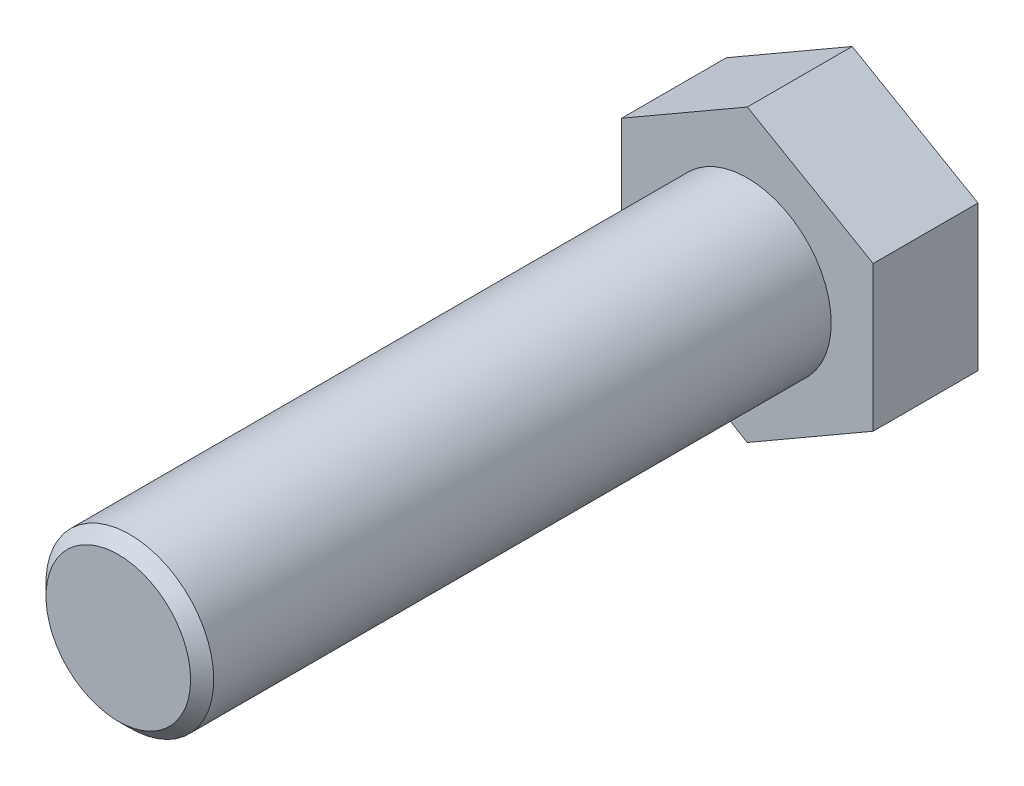
ISO-10303-21;
HEADER;
FILE_DESCRIPTION(('STEP AP214'),'2;1');
FILE_NAME('part.step','',(''),(''),'','','');
FILE_SCHEMA(('AUTOMOTIVE_DESIGN { 1 0 10303 214 1 1 1 1 }'));
ENDSEC;
DATA;
#1=APPLICATION_CONTEXT('core data for automotive mechanical design processes');
#2=APPLICATION_PROTOCOL_DEFINITION('international standard','automotive_design',2000,#1);
#3=PRODUCT_CONTEXT('',#1,'mechanical');
#4=PRODUCT('Part','Part','',(#3));
#5=PRODUCT_RELATED_PRODUCT_CATEGORY('part','',(#4));
#6=PRODUCT_DEFINITION_FORMATION('','',#4);
#7=PRODUCT_DEFINITION_CONTEXT('part definition',#1,'design');
#8=PRODUCT_DEFINITION('design','',#6,#7);
#9=PRODUCT_DEFINITION_SHAPE('','',#8);
#10=(LENGTH_UNIT() NAMED_UNIT(*) SI_UNIT(.MILLI.,.METRE.));
#11=(NAMED_UNIT(*) PLANE_ANGLE_UNIT() SI_UNIT($,.RADIAN.));
#12=(NAMED_UNIT(*) SI_UNIT($,.STERADIAN.) SOLID_ANGLE_UNIT());
#13=UNCERTAINTY_MEASURE_WITH_UNIT(LENGTH_MEASURE(1.E-05),#10,'distance_accuracy_value','');
#14=(GEOMETRIC_REPRESENTATION_CONTEXT(3) GLOBAL_UNCERTAINTY_ASSIGNED_CONTEXT((#13)) GLOBAL_UNIT_ASSIGNED_CONTEXT((#10,
#11,#12)) REPRESENTATION_CONTEXT('',''));
#15=CARTESIAN_POINT('',(0.,0.,0.));
#16=DIRECTION('',(0.,0.,1.));
#17=DIRECTION('',(1.,0.,0.));
#18=AXIS2_PLACEMENT_3D('',#15,#16,#17);
#19=CARTESIAN_POINT('',(-1.66533453693773E-13,0.,7.50000000000001));
#20=DIRECTION('',(0.,0.,1.));
#21=DIRECTION('',(1.,0.,0.));
#22=AXIS2_PLACEMENT_3D('',#19,#20,#21);
#23=PLANE('',#22);
#24=DIRECTION('',(0.,0.999999999999919,0.));
#25=VECTOR('',#24,1.);
#26=CARTESIAN_POINT('',(8.9999999999997,1.04083408558608E-13,7.50000000000001));
#27=LINE('',#26,#25);
#28=CARTESIAN_POINT('',(8.99999999999984,-5.19615242270625,7.50000000000001));
#29=VERTEX_POINT('',#28);
#30=CARTESIAN_POINT('',(9.00000000000004,5.19615242270679,7.50000000000001));
#31=VERTEX_POINT('',#30);
#32=EDGE_CURVE('E139',#29,#31,#27,.T.);
#33=ORIENTED_EDGE('',*,*,#32,.T.);
#34=DIRECTION('',(-0.866025403784453,0.49999999999996,0.));
#35=VECTOR('',#34,1.);
#36=CARTESIAN_POINT('',(4.50000000000016,7.79422863406067,7.50000000000001));
#37=LINE('',#36,#35);
#38=CARTESIAN_POINT('',(-2.08166817117217E-13,10.3923048454136,7.50000000000001));
#39=VERTEX_POINT('',#38);
#40=EDGE_CURVE('E97',#31,#39,#37,.T.);
#41=ORIENTED_EDGE('',*,*,#40,.T.);
#42=DIRECTION('',(-0.86602540378445,-0.499999999999954,0.));
#43=VECTOR('',#42,1.);
#44=CARTESIAN_POINT('',(-4.50000000000028,7.79422863405994,7.50000000000001));
#45=LINE('',#44,#43);
#46=CARTESIAN_POINT('',(-9.00000000000026,5.1961524227066,7.50000000000123));
#47=VERTEX_POINT('',#46);
#48=EDGE_CURVE('E110',#39,#47,#45,.T.);
#49=ORIENTED_EDGE('',*,*,#48,.T.);
#50=DIRECTION('',(0.,-0.999999999999923,0.));
#51=VECTOR('',#50,1.);
#52=CARTESIAN_POINT('',(-8.99999999999993,0.,7.50000000000001));
#53=LINE('',#52,#51);
#54=CARTESIAN_POINT('',(-9.0000000000002,-5.19615242270616,7.50000000000001));
#55=VERTEX_POINT('',#54);
#56=EDGE_CURVE('E104',#47,#55,#53,.T.);
#57=ORIENTED_EDGE('',*,*,#56,.T.);
#58=DIRECTION('',(0.866025403784453,-0.49999999999996,0.));
#59=VECTOR('',#58,1.);
#60=CARTESIAN_POINT('',(-4.50000000000095,-7.79422863405867,7.50000000000001));
#61=LINE('',#60,#59);
#62=CARTESIAN_POINT('',(-3.60822483003176E-13,-10.392304845412,7.50000000000001));
#63=VERTEX_POINT('',#62);
#64=EDGE_CURVE('E108',#55,#63,#61,.T.);
#65=ORIENTED_EDGE('',*,*,#64,.T.);
#66=DIRECTION('',(0.86602540378445,0.499999999999954,0.));
#67=VECTOR('',#66,1.);
#68=CARTESIAN_POINT('',(4.50000000000014,-7.79422863405962,7.50000000000001));
#69=LINE('',#68,#67);
#70=EDGE_CURVE('E59',#63,#29,#69,.T.);
#71=ORIENTED_EDGE('',*,*,#70,.T.);
#72=EDGE_LOOP('',(#33,#41,#49,#57,#65,#71));
#73=FACE_BOUND('',#72,.T.);
#74=CARTESIAN_POINT('',(-1.66533453693773E-13,0.,7.50000000000001));
#75=DIRECTION('',(0.,0.,1.));
#76=DIRECTION('',(1.,0.,0.));
#77=AXIS2_PLACEMENT_3D('',#74,#75,#76);
#78=CIRCLE('',#77,6.);
#79=CARTESIAN_POINT('',(5.99999999999984,0.,7.50000000000001));
#80=VERTEX_POINT('',#79);
#81=EDGE_CURVE('E132',#80,#80,#78,.T.);
#82=ORIENTED_EDGE('',*,*,#81,.F.);
#83=EDGE_LOOP('',(#82));
#84=FACE_BOUND('',#83,.T.);
#85=ADVANCED_FACE('F42',(#73,#84),#23,.T.);
#86=CARTESIAN_POINT('',(8.9999999999997,1.04083408558608E-13,7.50000000000001));
#87=DIRECTION('',(-1.,0.,0.));
#88=DIRECTION('',(0.,0.,1.));
#89=AXIS2_PLACEMENT_3D('',#86,#87,#88);
#90=PLANE('',#89);
#91=DIRECTION('',(0.,0.999999999999919,0.));
#92=VECTOR('',#91,1.);
#93=CARTESIAN_POINT('',(8.9999999999997,1.73472347597681E-13,0.));
#94=LINE('',#93,#92);
#95=CARTESIAN_POINT('',(8.99999999999948,-5.19615242270587,0.));
#96=VERTEX_POINT('',#95);
#97=CARTESIAN_POINT('',(8.99999999999995,5.19615242270657,0.));
#98=VERTEX_POINT('',#97);
#99=EDGE_CURVE('E128',#96,#98,#94,.T.);
#100=ORIENTED_EDGE('',*,*,#99,.T.);
#101=DIRECTION('',(0.,0.,-1.));
#102=VECTOR('',#101,1.);
#103=CARTESIAN_POINT('',(9.00000000000004,5.19615242270679,7.50000000000001));
#104=LINE('',#103,#102);
#105=EDGE_CURVE('E146',#31,#98,#104,.T.);
#106=ORIENTED_EDGE('',*,*,#105,.F.);
#107=ORIENTED_EDGE('',*,*,#32,.F.);
#108=DIRECTION('',(0.,0.,-1.));
#109=VECTOR('',#108,1.);
#110=CARTESIAN_POINT('',(8.99999999999984,-5.19615242270625,7.50000000000001));
#111=LINE('',#110,#109);
#112=EDGE_CURVE('E124',#29,#96,#111,.T.);
#113=ORIENTED_EDGE('',*,*,#112,.T.);
#114=EDGE_LOOP('',(#100,#106,#107,#113));
#115=FACE_BOUND('',#114,.T.);
#116=ADVANCED_FACE('F161',(#115),#90,.F.);
#117=CARTESIAN_POINT('',(4.50000000000016,7.79422863406067,7.50000000000001));
#118=DIRECTION('',(-0.499999999999999,-0.866025403784376,0.));
#119=DIRECTION('',(0.866025403784453,-0.49999999999996,0.));
#120=AXIS2_PLACEMENT_3D('',#117,#118,#119);
#121=PLANE('',#120);
#122=DIRECTION('',(-0.866025403784453,0.49999999999996,0.));
#123=VECTOR('',#122,1.);
#124=CARTESIAN_POINT('',(4.49999999999989,7.79422863406005,0.));
#125=LINE('',#124,#123);
#126=CARTESIAN_POINT('',(-3.33066907387547E-13,10.3923048454135,0.));
#127=VERTEX_POINT('',#126);
#128=EDGE_CURVE('E131',#98,#127,#125,.T.);
#129=ORIENTED_EDGE('',*,*,#128,.T.);
#130=DIRECTION('',(0.,0.,-1.));
#131=VECTOR('',#130,1.);
#132=CARTESIAN_POINT('',(-2.08166817117217E-13,10.3923048454136,7.50000000000001));
#133=LINE('',#132,#131);
#134=EDGE_CURVE('E143',#39,#127,#133,.T.);
#135=ORIENTED_EDGE('',*,*,#134,.F.);
#136=ORIENTED_EDGE('',*,*,#40,.F.);
#137=ORIENTED_EDGE('',*,*,#105,.T.);
#138=EDGE_LOOP('',(#129,#135,#136,#137));
#139=FACE_BOUND('',#138,.T.);
#140=ADVANCED_FACE('F166',(#139),#121,.F.);
#141=CARTESIAN_POINT('',(-4.50000000000028,7.79422863405994,7.50000000000001));
#142=DIRECTION('',(0.500000000000005,-0.866025403784376,0.));
#143=DIRECTION('',(0.86602540378445,0.499999999999954,0.));
#144=AXIS2_PLACEMENT_3D('',#141,#142,#143);
#145=PLANE('',#144);
#146=DIRECTION('',(-0.86602540378445,-0.499999999999954,0.));
#147=VECTOR('',#146,1.);
#148=CARTESIAN_POINT('',(-4.50000000000027,7.79422863405993,0.));
#149=LINE('',#148,#147);
#150=CARTESIAN_POINT('',(-9.00000000000026,5.1961524227066,1.22124532708767E-12));
#151=VERTEX_POINT('',#150);
#152=EDGE_CURVE('E134',#127,#151,#149,.T.);
#153=ORIENTED_EDGE('',*,*,#152,.T.);
#154=DIRECTION('',(0.,0.,-1.));
#155=VECTOR('',#154,1.);
#156=CARTESIAN_POINT('',(-9.00000000000026,5.1961524227066,7.50000000000123));
#157=LINE('',#156,#155);
#158=EDGE_CURVE('E119',#47,#151,#157,.T.);
#159=ORIENTED_EDGE('',*,*,#158,.F.);
#160=ORIENTED_EDGE('',*,*,#48,.F.);
#161=ORIENTED_EDGE('',*,*,#134,.T.);
#162=EDGE_LOOP('',(#153,#159,#160,#161));
#163=FACE_BOUND('',#162,.T.);
#164=ADVANCED_FACE('F181',(#163),#145,.F.);
#165=CARTESIAN_POINT('',(-8.99999999999993,0.,7.50000000000001));
#166=DIRECTION('',(1.00000000000004,0.,0.));
#167=DIRECTION('',(0.,0.999999999999923,0.));
#168=AXIS2_PLACEMENT_3D('',#165,#166,#167);
#169=PLANE('',#168);
#170=DIRECTION('',(0.,-0.999999999999923,0.));
#171=VECTOR('',#170,1.);
#172=CARTESIAN_POINT('',(-9.00000000000012,0.,0.));
#173=LINE('',#172,#171);
#174=CARTESIAN_POINT('',(-9.00000000000037,-5.19615242270587,0.));
#175=VERTEX_POINT('',#174);
#176=EDGE_CURVE('E118',#151,#175,#173,.T.);
#177=ORIENTED_EDGE('',*,*,#176,.T.);
#178=DIRECTION('',(0.,0.,-1.));
#179=VECTOR('',#178,1.);
#180=CARTESIAN_POINT('',(-9.0000000000002,-5.19615242270616,7.50000000000001));
#181=LINE('',#180,#179);
#182=EDGE_CURVE('E115',#55,#175,#181,.T.);
#183=ORIENTED_EDGE('',*,*,#182,.F.);
#184=ORIENTED_EDGE('',*,*,#56,.F.);
#185=ORIENTED_EDGE('',*,*,#158,.T.);
#186=EDGE_LOOP('',(#177,#183,#184,#185));
#187=FACE_BOUND('',#186,.T.);
#188=ADVANCED_FACE('F116',(#187),#169,.F.);
#189=CARTESIAN_POINT('',(-4.50000000000095,-7.79422863405867,7.50000000000001));
#190=DIRECTION('',(0.499999999999999,0.866025403784376,0.));
#191=DIRECTION('',(-0.866025403784453,0.49999999999996,0.));
#192=AXIS2_PLACEMENT_3D('',#189,#190,#191);
#193=PLANE('',#192);
#194=DIRECTION('',(0.866025403784453,-0.49999999999996,0.));
#195=VECTOR('',#194,1.);
#196=CARTESIAN_POINT('',(-4.50000000000093,-7.79422863405892,0.));
#197=LINE('',#196,#195);
#198=CARTESIAN_POINT('',(-3.33066907387547E-13,-10.3923048454121,0.));
#199=VERTEX_POINT('',#198);
#200=EDGE_CURVE('E82',#175,#199,#197,.T.);
#201=ORIENTED_EDGE('',*,*,#200,.T.);
#202=DIRECTION('',(0.,0.,-1.));
#203=VECTOR('',#202,1.);
#204=CARTESIAN_POINT('',(-3.60822483003176E-13,-10.392304845412,7.50000000000001));
#205=LINE('',#204,#203);
#206=EDGE_CURVE('E120',#63,#199,#205,.T.);
#207=ORIENTED_EDGE('',*,*,#206,.F.);
#208=ORIENTED_EDGE('',*,*,#64,.F.);
#209=ORIENTED_EDGE('',*,*,#182,.T.);
#210=EDGE_LOOP('',(#201,#207,#208,#209));
#211=FACE_BOUND('',#210,.T.);
#212=ADVANCED_FACE('F122',(#211),#193,.F.);
#213=CARTESIAN_POINT('',(4.50000000000014,-7.79422863405962,7.50000000000001));
#214=DIRECTION('',(-0.500000000000005,0.866025403784376,0.));
#215=DIRECTION('',(-0.86602540378445,-0.499999999999954,0.));
#216=AXIS2_PLACEMENT_3D('',#213,#214,#215);
#217=PLANE('',#216);
#218=DIRECTION('',(0.86602540378445,0.499999999999954,0.));
#219=VECTOR('',#218,1.);
#220=CARTESIAN_POINT('',(4.49999999999986,-7.79422863405874,0.));
#221=LINE('',#220,#219);
#222=EDGE_CURVE('E88',#199,#96,#221,.T.);
#223=ORIENTED_EDGE('',*,*,#222,.T.);
#224=ORIENTED_EDGE('',*,*,#112,.F.);
#225=ORIENTED_EDGE('',*,*,#70,.F.);
#226=ORIENTED_EDGE('',*,*,#206,.T.);
#227=EDGE_LOOP('',(#223,#224,#225,#226));
#228=FACE_BOUND('',#227,.T.);
#229=ADVANCED_FACE('F173',(#228),#217,.F.);
#230=CARTESIAN_POINT('',(0.,0.,0.));
#231=DIRECTION('',(0.,0.,1.));
#232=DIRECTION('',(1.,0.,0.));
#233=AXIS2_PLACEMENT_3D('',#230,#231,#232);
#234=PLANE('',#233);
#235=ORIENTED_EDGE('',*,*,#99,.F.);
#236=ORIENTED_EDGE('',*,*,#222,.F.);
#237=ORIENTED_EDGE('',*,*,#200,.F.);
#238=ORIENTED_EDGE('',*,*,#176,.F.);
#239=ORIENTED_EDGE('',*,*,#152,.F.);
#240=ORIENTED_EDGE('',*,*,#128,.F.);
#241=EDGE_LOOP('',(#235,#236,#237,#238,#239,#240));
#242=FACE_BOUND('',#241,.T.);
#243=ADVANCED_FACE('F170',(#242),#234,.F.);
#244=CARTESIAN_POINT('',(-3.46944695195361E-13,9.43689570931383E-13,52.5));
#245=DIRECTION('',(0.,0.,-1.));
#246=DIRECTION('',(-1.,0.,0.));
#247=AXIS2_PLACEMENT_3D('',#244,#245,#246);
#248=CYLINDRICAL_SURFACE('',#247,6.);
#249=CARTESIAN_POINT('',(-1.66533453693773E-13,8.11850586757146E-13,51.672));
#250=DIRECTION('',(0.,0.,1.));
#251=DIRECTION('',(1.,0.,0.));
#252=AXIS2_PLACEMENT_3D('',#249,#250,#251);
#253=CIRCLE('',#252,6.);
#254=CARTESIAN_POINT('',(5.99999999999984,8.0718765005372E-13,51.672));
#255=VERTEX_POINT('',#254);
#256=EDGE_CURVE('E11',#255,#255,#253,.F.);
#257=ORIENTED_EDGE('',*,*,#256,.T.);
#258=EDGE_LOOP('',(#257));
#259=FACE_BOUND('',#258,.T.);
#260=ORIENTED_EDGE('',*,*,#81,.T.);
#261=EDGE_LOOP('',(#260));
#262=FACE_BOUND('',#261,.T.);
#263=ADVANCED_FACE('F157',(#259,#262),#248,.T.);
#264=CARTESIAN_POINT('',(-3.46944695195361E-13,9.43689570931383E-13,52.5));
#265=DIRECTION('',(0.,0.,1.));
#266=DIRECTION('',(1.,0.,0.));
#267=AXIS2_PLACEMENT_3D('',#264,#265,#266);
#268=PLANE('',#267);
#269=CARTESIAN_POINT('',(-3.46944695195361E-13,9.43689570931383E-13,52.5));
#270=DIRECTION('',(0.,0.,1.));
#271=DIRECTION('',(1.,0.,0.));
#272=AXIS2_PLACEMENT_3D('',#269,#270,#271);
#273=CIRCLE('',#272,5.17200000000002);
#274=CARTESIAN_POINT('',(5.17199999999967,9.3967011949303E-13,52.5));
#275=VERTEX_POINT('',#274);
#276=EDGE_CURVE('E51',#275,#275,#273,.T.);
#277=ORIENTED_EDGE('',*,*,#276,.T.);
#278=EDGE_LOOP('',(#277));
#279=FACE_BOUND('',#278,.T.);
#280=ADVANCED_FACE('F150',(#279),#268,.T.);
#281=CARTESIAN_POINT('',(-3.46944695195361E-13,9.43689570931383E-13,52.5));
#282=DIRECTION('',(0.,0.,-1.));
#283=DIRECTION('',(-1.,0.,0.));
#284=AXIS2_PLACEMENT_3D('',#281,#282,#283);
#285=CONICAL_SURFACE('',#284,5.17200000000002,0.78539816339745);
#286=ORIENTED_EDGE('',*,*,#256,.F.);
#287=EDGE_LOOP('',(#286));
#288=FACE_BOUND('',#287,.T.);
#289=ORIENTED_EDGE('',*,*,#276,.F.);
#290=EDGE_LOOP('',(#289));
#291=FACE_BOUND('',#290,.T.);
#292=ADVANCED_FACE('F44',(#288,#291),#285,.T.);
#293=CLOSED_SHELL('',(#85,#116,#140,#164,#188,#212,#229,#243,#263,#280,#292));
#294=MANIFOLD_SOLID_BREP('B2',#293);
#295=ADVANCED_BREP_SHAPE_REPRESENTATION('',(#18,#294),#14);
#296=SHAPE_DEFINITION_REPRESENTATION(#9,#295);
ENDSEC;
END-ISO-10303-21;
